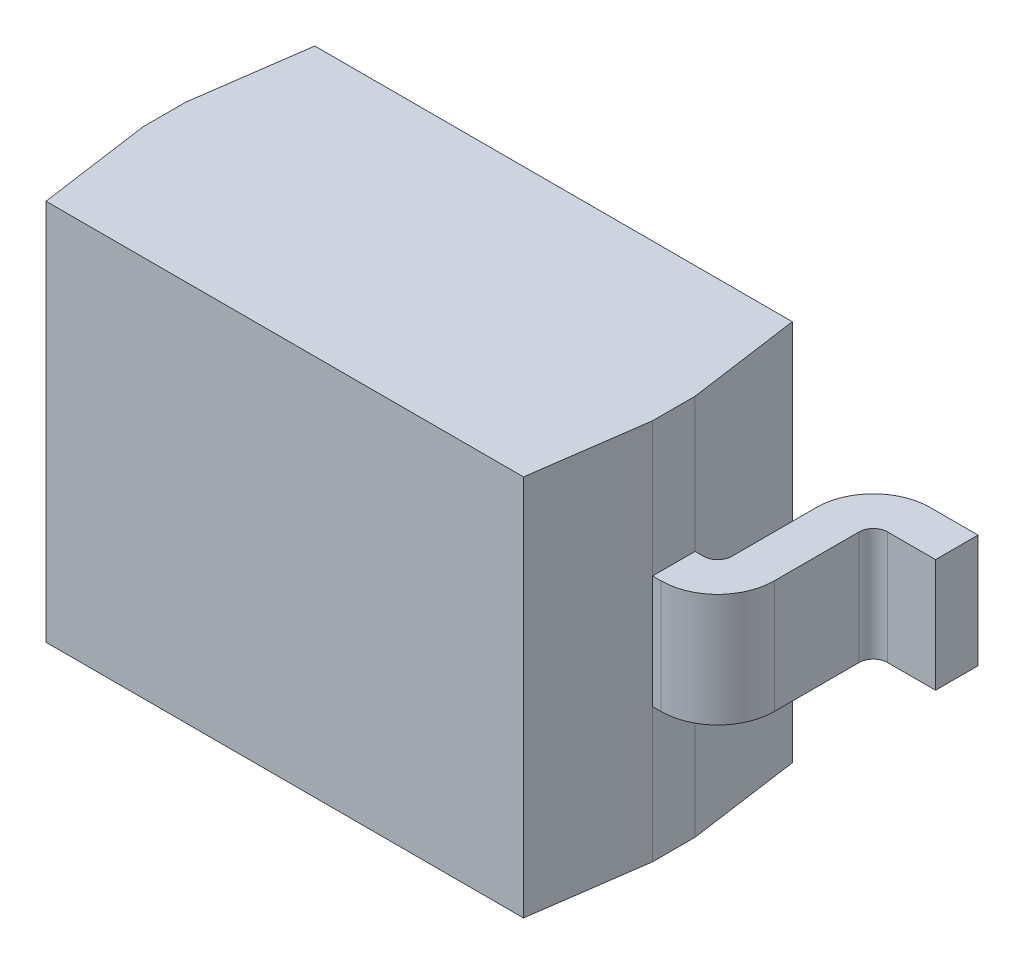
ISO-10303-21;
HEADER;
FILE_DESCRIPTION(('STEP AP214'),'2;1');
FILE_NAME('part.step','',(''),(''),'','','');
FILE_SCHEMA(('AUTOMOTIVE_DESIGN { 1 0 10303 214 1 1 1 1 }'));
ENDSEC;
DATA;
#1=APPLICATION_CONTEXT('core data for automotive mechanical design processes');
#2=APPLICATION_PROTOCOL_DEFINITION('international standard','automotive_design',2000,#1);
#3=PRODUCT_CONTEXT('',#1,'mechanical');
#4=PRODUCT('Part','Part','',(#3));
#5=PRODUCT_RELATED_PRODUCT_CATEGORY('part','',(#4));
#6=PRODUCT_DEFINITION_FORMATION('','',#4);
#7=PRODUCT_DEFINITION_CONTEXT('part definition',#1,'design');
#8=PRODUCT_DEFINITION('design','',#6,#7);
#9=PRODUCT_DEFINITION_SHAPE('','',#8);
#10=(LENGTH_UNIT() NAMED_UNIT(*) SI_UNIT(.MILLI.,.METRE.));
#11=(NAMED_UNIT(*) PLANE_ANGLE_UNIT() SI_UNIT($,.RADIAN.));
#12=(NAMED_UNIT(*) SI_UNIT($,.STERADIAN.) SOLID_ANGLE_UNIT());
#13=UNCERTAINTY_MEASURE_WITH_UNIT(LENGTH_MEASURE(1.E-05),#10,'distance_accuracy_value','');
#14=(GEOMETRIC_REPRESENTATION_CONTEXT(3) GLOBAL_UNCERTAINTY_ASSIGNED_CONTEXT((#13)) GLOBAL_UNIT_ASSIGNED_CONTEXT((#10,
#11,#12)) REPRESENTATION_CONTEXT('',''));
#15=CARTESIAN_POINT('',(0.,0.,0.));
#16=DIRECTION('',(0.,0.,1.));
#17=DIRECTION('',(1.,0.,0.));
#18=AXIS2_PLACEMENT_3D('',#15,#16,#17);
#19=CARTESIAN_POINT('',(0.93,0.2,0.5));
#20=DIRECTION('',(0.,-1.,0.));
#21=DIRECTION('',(0.,0.,-1.));
#22=AXIS2_PLACEMENT_3D('',#19,#20,#21);
#23=CYLINDRICAL_SURFACE('',#22,0.2);
#24=CARTESIAN_POINT('',(0.93,-0.2,0.5));
#25=DIRECTION('',(0.,-1.,0.));
#26=DIRECTION('',(0.,0.,-1.));
#27=AXIS2_PLACEMENT_3D('',#24,#25,#26);
#28=CIRCLE('',#27,0.2);
#29=CARTESIAN_POINT('',(0.93,-0.2,0.7));
#30=VERTEX_POINT('',#29);
#31=CARTESIAN_POINT('',(1.13,-0.2,0.5));
#32=VERTEX_POINT('',#31);
#33=EDGE_CURVE('E20',#30,#32,#28,.F.);
#34=ORIENTED_EDGE('',*,*,#33,.T.);
#35=DIRECTION('',(0.,1.,0.));
#36=VECTOR('',#35,1.);
#37=CARTESIAN_POINT('',(1.13,0.2,0.5));
#38=LINE('',#37,#36);
#39=CARTESIAN_POINT('',(1.13,0.2,0.5));
#40=VERTEX_POINT('',#39);
#41=EDGE_CURVE('E230',#40,#32,#38,.F.);
#42=ORIENTED_EDGE('',*,*,#41,.F.);
#43=CARTESIAN_POINT('',(0.93,0.2,0.5));
#44=DIRECTION('',(0.,-1.,0.));
#45=DIRECTION('',(0.,0.,-1.));
#46=AXIS2_PLACEMENT_3D('',#43,#44,#45);
#47=CIRCLE('',#46,0.2);
#48=CARTESIAN_POINT('',(0.93,0.2,0.7));
#49=VERTEX_POINT('',#48);
#50=EDGE_CURVE('E452',#49,#40,#47,.F.);
#51=ORIENTED_EDGE('',*,*,#50,.F.);
#52=DIRECTION('',(0.,-1.,0.));
#53=VECTOR('',#52,1.);
#54=CARTESIAN_POINT('',(0.93,0.2,0.7));
#55=LINE('',#54,#53);
#56=EDGE_CURVE('E223',#30,#49,#55,.F.);
#57=ORIENTED_EDGE('',*,*,#56,.F.);
#58=EDGE_LOOP('',(#34,#42,#51,#57));
#59=FACE_BOUND('',#58,.T.);
#60=ADVANCED_FACE('F17',(#59),#23,.T.);
#61=CARTESIAN_POINT('',(1.13,0.2,0.2));
#62=DIRECTION('',(1.,0.,0.));
#63=DIRECTION('',(0.,0.,-1.));
#64=AXIS2_PLACEMENT_3D('',#61,#62,#63);
#65=PLANE('',#64);
#66=DIRECTION('',(0.,0.,1.));
#67=VECTOR('',#66,1.);
#68=CARTESIAN_POINT('',(1.13,-0.2,0.7));
#69=LINE('',#68,#67);
#70=CARTESIAN_POINT('',(1.13,-0.2,0.2));
#71=VERTEX_POINT('',#70);
#72=EDGE_CURVE('E234',#32,#71,#69,.F.);
#73=ORIENTED_EDGE('',*,*,#72,.T.);
#74=DIRECTION('',(0.,-1.,0.));
#75=VECTOR('',#74,1.);
#76=CARTESIAN_POINT('',(1.13,0.2,0.2));
#77=LINE('',#76,#75);
#78=CARTESIAN_POINT('',(1.13,0.2,0.2));
#79=VERTEX_POINT('',#78);
#80=EDGE_CURVE('E236',#71,#79,#77,.F.);
#81=ORIENTED_EDGE('',*,*,#80,.T.);
#82=DIRECTION('',(0.,0.,1.));
#83=VECTOR('',#82,1.);
#84=CARTESIAN_POINT('',(1.13,0.2,0.7));
#85=LINE('',#84,#83);
#86=EDGE_CURVE('E235',#40,#79,#85,.F.);
#87=ORIENTED_EDGE('',*,*,#86,.F.);
#88=ORIENTED_EDGE('',*,*,#41,.T.);
#89=EDGE_LOOP('',(#73,#81,#87,#88));
#90=FACE_BOUND('',#89,.T.);
#91=ADVANCED_FACE('F232',(#90),#65,.T.);
#92=CARTESIAN_POINT('',(1.18,0.2,0.2));
#93=DIRECTION('',(0.,-1.,0.));
#94=DIRECTION('',(0.,0.,-1.));
#95=AXIS2_PLACEMENT_3D('',#92,#93,#94);
#96=CYLINDRICAL_SURFACE('',#95,0.05);
#97=ORIENTED_EDGE('',*,*,#80,.F.);
#98=CARTESIAN_POINT('',(1.18,-0.2,0.2));
#99=DIRECTION('',(0.,-1.,0.));
#100=DIRECTION('',(0.,0.,-1.));
#101=AXIS2_PLACEMENT_3D('',#98,#99,#100);
#102=CIRCLE('',#101,0.05);
#103=CARTESIAN_POINT('',(1.18,-0.2,0.15));
#104=VERTEX_POINT('',#103);
#105=EDGE_CURVE('E245',#71,#104,#102,.T.);
#106=ORIENTED_EDGE('',*,*,#105,.T.);
#107=DIRECTION('',(0.,-1.,0.));
#108=VECTOR('',#107,1.);
#109=CARTESIAN_POINT('',(1.18,0.2,0.15));
#110=LINE('',#109,#108);
#111=CARTESIAN_POINT('',(1.18,0.2,0.15));
#112=VERTEX_POINT('',#111);
#113=EDGE_CURVE('E396',#112,#104,#110,.T.);
#114=ORIENTED_EDGE('',*,*,#113,.F.);
#115=CARTESIAN_POINT('',(1.18,0.2,0.2));
#116=DIRECTION('',(0.,-1.,0.));
#117=DIRECTION('',(0.,0.,-1.));
#118=AXIS2_PLACEMENT_3D('',#115,#116,#117);
#119=CIRCLE('',#118,0.05);
#120=EDGE_CURVE('E450',#79,#112,#119,.T.);
#121=ORIENTED_EDGE('',*,*,#120,.F.);
#122=EDGE_LOOP('',(#97,#106,#114,#121));
#123=FACE_BOUND('',#122,.T.);
#124=ADVANCED_FACE('F724',(#123),#96,.F.);
#125=CARTESIAN_POINT('',(1.35,0.2,0.15));
#126=DIRECTION('',(0.,0.,1.));
#127=DIRECTION('',(0.,-1.,0.));
#128=AXIS2_PLACEMENT_3D('',#125,#126,#127);
#129=PLANE('',#128);
#130=DIRECTION('',(1.,0.,0.));
#131=VECTOR('',#130,1.);
#132=CARTESIAN_POINT('',(0.9,-0.2,0.15));
#133=LINE('',#132,#131);
#134=CARTESIAN_POINT('',(1.35,-0.2,0.15));
#135=VERTEX_POINT('',#134);
#136=EDGE_CURVE('E414',#104,#135,#133,.T.);
#137=ORIENTED_EDGE('',*,*,#136,.T.);
#138=DIRECTION('',(0.,1.,0.));
#139=VECTOR('',#138,1.);
#140=CARTESIAN_POINT('',(1.35,0.2,0.15));
#141=LINE('',#140,#139);
#142=CARTESIAN_POINT('',(1.35,0.2,0.15));
#143=VERTEX_POINT('',#142);
#144=EDGE_CURVE('E386',#143,#135,#141,.F.);
#145=ORIENTED_EDGE('',*,*,#144,.F.);
#146=DIRECTION('',(1.,0.,0.));
#147=VECTOR('',#146,1.);
#148=CARTESIAN_POINT('',(0.9,0.2,0.15));
#149=LINE('',#148,#147);
#150=EDGE_CURVE('E392',#112,#143,#149,.T.);
#151=ORIENTED_EDGE('',*,*,#150,.F.);
#152=ORIENTED_EDGE('',*,*,#113,.T.);
#153=EDGE_LOOP('',(#137,#145,#151,#152));
#154=FACE_BOUND('',#153,.T.);
#155=ADVANCED_FACE('F720',(#154),#129,.T.);
#156=CARTESIAN_POINT('',(1.35,0.2,0.));
#157=DIRECTION('',(1.,0.,0.));
#158=DIRECTION('',(0.,0.,-1.));
#159=AXIS2_PLACEMENT_3D('',#156,#157,#158);
#160=PLANE('',#159);
#161=DIRECTION('',(0.,0.,1.));
#162=VECTOR('',#161,1.);
#163=CARTESIAN_POINT('',(1.35,-0.2,0.7));
#164=LINE('',#163,#162);
#165=CARTESIAN_POINT('',(1.35,-0.2,0.));
#166=VERTEX_POINT('',#165);
#167=EDGE_CURVE('E410',#135,#166,#164,.F.);
#168=ORIENTED_EDGE('',*,*,#167,.T.);
#169=DIRECTION('',(0.,1.,0.));
#170=VECTOR('',#169,1.);
#171=CARTESIAN_POINT('',(1.35,0.2,0.));
#172=LINE('',#171,#170);
#173=CARTESIAN_POINT('',(1.35,0.2,0.));
#174=VERTEX_POINT('',#173);
#175=EDGE_CURVE('E384',#174,#166,#172,.F.);
#176=ORIENTED_EDGE('',*,*,#175,.F.);
#177=DIRECTION('',(0.,0.,1.));
#178=VECTOR('',#177,1.);
#179=CARTESIAN_POINT('',(1.35,0.2,0.7));
#180=LINE('',#179,#178);
#181=EDGE_CURVE('E389',#143,#174,#180,.F.);
#182=ORIENTED_EDGE('',*,*,#181,.F.);
#183=ORIENTED_EDGE('',*,*,#144,.T.);
#184=EDGE_LOOP('',(#168,#176,#182,#183));
#185=FACE_BOUND('',#184,.T.);
#186=ADVANCED_FACE('F716',(#185),#160,.T.);
#187=CARTESIAN_POINT('',(1.18,0.2,0.));
#188=DIRECTION('',(0.,0.,-1.));
#189=DIRECTION('',(0.,1.,0.));
#190=AXIS2_PLACEMENT_3D('',#187,#188,#189);
#191=PLANE('',#190);
#192=DIRECTION('',(1.,0.,0.));
#193=VECTOR('',#192,1.);
#194=CARTESIAN_POINT('',(0.9,-0.2,0.));
#195=LINE('',#194,#193);
#196=CARTESIAN_POINT('',(1.18,-0.2,0.));
#197=VERTEX_POINT('',#196);
#198=EDGE_CURVE('E413',#166,#197,#195,.F.);
#199=ORIENTED_EDGE('',*,*,#198,.T.);
#200=DIRECTION('',(0.,-1.,0.));
#201=VECTOR('',#200,1.);
#202=CARTESIAN_POINT('',(1.18,0.2,0.));
#203=LINE('',#202,#201);
#204=CARTESIAN_POINT('',(1.18,0.2,0.));
#205=VERTEX_POINT('',#204);
#206=EDGE_CURVE('E382',#205,#197,#203,.T.);
#207=ORIENTED_EDGE('',*,*,#206,.F.);
#208=DIRECTION('',(1.,0.,0.));
#209=VECTOR('',#208,1.);
#210=CARTESIAN_POINT('',(0.9,0.2,0.));
#211=LINE('',#210,#209);
#212=EDGE_CURVE('E391',#174,#205,#211,.F.);
#213=ORIENTED_EDGE('',*,*,#212,.F.);
#214=ORIENTED_EDGE('',*,*,#175,.T.);
#215=EDGE_LOOP('',(#199,#207,#213,#214));
#216=FACE_BOUND('',#215,.T.);
#217=ADVANCED_FACE('F712',(#216),#191,.T.);
#218=CARTESIAN_POINT('',(1.18,0.2,0.2));
#219=DIRECTION('',(0.,-1.,0.));
#220=DIRECTION('',(0.,0.,-1.));
#221=AXIS2_PLACEMENT_3D('',#218,#219,#220);
#222=CYLINDRICAL_SURFACE('',#221,0.2);
#223=CARTESIAN_POINT('',(1.18,-0.2,0.2));
#224=DIRECTION('',(0.,-1.,0.));
#225=DIRECTION('',(0.,0.,-1.));
#226=AXIS2_PLACEMENT_3D('',#223,#224,#225);
#227=CIRCLE('',#226,0.2);
#228=CARTESIAN_POINT('',(0.98,-0.2,0.2));
#229=VERTEX_POINT('',#228);
#230=EDGE_CURVE('E459',#197,#229,#227,.F.);
#231=ORIENTED_EDGE('',*,*,#230,.T.);
#232=DIRECTION('',(0.,1.,0.));
#233=VECTOR('',#232,1.);
#234=CARTESIAN_POINT('',(0.98,0.2,0.2));
#235=LINE('',#234,#233);
#236=CARTESIAN_POINT('',(0.98,0.2,0.2));
#237=VERTEX_POINT('',#236);
#238=EDGE_CURVE('E380',#237,#229,#235,.F.);
#239=ORIENTED_EDGE('',*,*,#238,.F.);
#240=CARTESIAN_POINT('',(1.18,0.2,0.2));
#241=DIRECTION('',(0.,-1.,0.));
#242=DIRECTION('',(0.,0.,-1.));
#243=AXIS2_PLACEMENT_3D('',#240,#241,#242);
#244=CIRCLE('',#243,0.2);
#245=EDGE_CURVE('E448',#205,#237,#244,.F.);
#246=ORIENTED_EDGE('',*,*,#245,.F.);
#247=ORIENTED_EDGE('',*,*,#206,.T.);
#248=EDGE_LOOP('',(#231,#239,#246,#247));
#249=FACE_BOUND('',#248,.T.);
#250=ADVANCED_FACE('F708',(#249),#222,.T.);
#251=CARTESIAN_POINT('',(0.98,0.2,0.5));
#252=DIRECTION('',(-1.,0.,0.));
#253=DIRECTION('',(0.,0.,1.));
#254=AXIS2_PLACEMENT_3D('',#251,#252,#253);
#255=PLANE('',#254);
#256=DIRECTION('',(0.,0.,1.));
#257=VECTOR('',#256,1.);
#258=CARTESIAN_POINT('',(0.98,-0.2,0.7));
#259=LINE('',#258,#257);
#260=CARTESIAN_POINT('',(0.98,-0.2,0.5));
#261=VERTEX_POINT('',#260);
#262=EDGE_CURVE('E458',#229,#261,#259,.T.);
#263=ORIENTED_EDGE('',*,*,#262,.T.);
#264=DIRECTION('',(0.,-1.,0.));
#265=VECTOR('',#264,1.);
#266=CARTESIAN_POINT('',(0.98,0.2,0.5));
#267=LINE('',#266,#265);
#268=CARTESIAN_POINT('',(0.98,0.2,0.5));
#269=VERTEX_POINT('',#268);
#270=EDGE_CURVE('E248',#261,#269,#267,.F.);
#271=ORIENTED_EDGE('',*,*,#270,.T.);
#272=DIRECTION('',(0.,0.,1.));
#273=VECTOR('',#272,1.);
#274=CARTESIAN_POINT('',(0.98,0.2,0.7));
#275=LINE('',#274,#273);
#276=EDGE_CURVE('E447',#237,#269,#275,.T.);
#277=ORIENTED_EDGE('',*,*,#276,.F.);
#278=ORIENTED_EDGE('',*,*,#238,.T.);
#279=EDGE_LOOP('',(#263,#271,#277,#278));
#280=FACE_BOUND('',#279,.T.);
#281=ADVANCED_FACE('F705',(#280),#255,.T.);
#282=CARTESIAN_POINT('',(0.93,0.2,0.7));
#283=DIRECTION('',(0.,0.,1.));
#284=DIRECTION('',(0.,-1.,0.));
#285=AXIS2_PLACEMENT_3D('',#282,#283,#284);
#286=PLANE('',#285);
#287=DIRECTION('',(1.,0.,0.));
#288=VECTOR('',#287,1.);
#289=CARTESIAN_POINT('',(0.9,-0.2,0.7));
#290=LINE('',#289,#288);
#291=CARTESIAN_POINT('',(0.9,-0.2,0.7));
#292=VERTEX_POINT('',#291);
#293=EDGE_CURVE('E247',#292,#30,#290,.T.);
#294=ORIENTED_EDGE('',*,*,#293,.T.);
#295=ORIENTED_EDGE('',*,*,#56,.T.);
#296=DIRECTION('',(1.,0.,0.));
#297=VECTOR('',#296,1.);
#298=CARTESIAN_POINT('',(0.9,0.2,0.7));
#299=LINE('',#298,#297);
#300=CARTESIAN_POINT('',(0.9,0.2,0.7));
#301=VERTEX_POINT('',#300);
#302=EDGE_CURVE('E454',#301,#49,#299,.T.);
#303=ORIENTED_EDGE('',*,*,#302,.F.);
#304=DIRECTION('',(0.,1.,0.));
#305=VECTOR('',#304,1.);
#306=CARTESIAN_POINT('',(0.9,0.,0.7));
#307=LINE('',#306,#305);
#308=EDGE_CURVE('E366',#292,#301,#307,.T.);
#309=ORIENTED_EDGE('',*,*,#308,.F.);
#310=EDGE_LOOP('',(#294,#295,#303,#309));
#311=FACE_BOUND('',#310,.T.);
#312=ADVANCED_FACE('F701',(#311),#286,.T.);
#313=CARTESIAN_POINT('',(-0.93,-0.2,0.7));
#314=DIRECTION('',(0.,0.,1.));
#315=DIRECTION('',(0.,-1.,0.));
#316=AXIS2_PLACEMENT_3D('',#313,#314,#315);
#317=PLANE('',#316);
#318=DIRECTION('',(1.,0.,0.));
#319=VECTOR('',#318,1.);
#320=CARTESIAN_POINT('',(-0.9,0.2,0.7));
#321=LINE('',#320,#319);
#322=CARTESIAN_POINT('',(-0.9,0.2,0.7));
#323=VERTEX_POINT('',#322);
#324=CARTESIAN_POINT('',(-0.93,0.2,0.7));
#325=VERTEX_POINT('',#324);
#326=EDGE_CURVE('E434',#323,#325,#321,.F.);
#327=ORIENTED_EDGE('',*,*,#326,.T.);
#328=DIRECTION('',(0.,1.,0.));
#329=VECTOR('',#328,1.);
#330=CARTESIAN_POINT('',(-0.93,-0.2,0.7));
#331=LINE('',#330,#329);
#332=CARTESIAN_POINT('',(-0.93,-0.2,0.7));
#333=VERTEX_POINT('',#332);
#334=EDGE_CURVE('E330',#333,#325,#331,.T.);
#335=ORIENTED_EDGE('',*,*,#334,.F.);
#336=DIRECTION('',(1.,0.,0.));
#337=VECTOR('',#336,1.);
#338=CARTESIAN_POINT('',(-0.9,-0.2,0.7));
#339=LINE('',#338,#337);
#340=CARTESIAN_POINT('',(-0.9,-0.2,0.7));
#341=VERTEX_POINT('',#340);
#342=EDGE_CURVE('E353',#341,#333,#339,.F.);
#343=ORIENTED_EDGE('',*,*,#342,.F.);
#344=DIRECTION('',(0.,1.,0.));
#345=VECTOR('',#344,1.);
#346=CARTESIAN_POINT('',(-0.9,0.,0.7));
#347=LINE('',#346,#345);
#348=EDGE_CURVE('E338',#323,#341,#347,.F.);
#349=ORIENTED_EDGE('',*,*,#348,.F.);
#350=EDGE_LOOP('',(#327,#335,#343,#349));
#351=FACE_BOUND('',#350,.T.);
#352=ADVANCED_FACE('F697',(#351),#317,.T.);
#353=CARTESIAN_POINT('',(-0.93,-0.2,0.5));
#354=DIRECTION('',(0.,1.,0.));
#355=DIRECTION('',(-1.,0.,0.));
#356=AXIS2_PLACEMENT_3D('',#353,#354,#355);
#357=CYLINDRICAL_SURFACE('',#356,0.2);
#358=CARTESIAN_POINT('',(-0.93,0.2,0.5));
#359=DIRECTION('',(0.,1.,0.));
#360=DIRECTION('',(-1.,0.,0.));
#361=AXIS2_PLACEMENT_3D('',#358,#359,#360);
#362=CIRCLE('',#361,0.2);
#363=CARTESIAN_POINT('',(-1.13,0.2,0.5));
#364=VERTEX_POINT('',#363);
#365=EDGE_CURVE('E431',#325,#364,#362,.F.);
#366=ORIENTED_EDGE('',*,*,#365,.T.);
#367=DIRECTION('',(0.,-1.,0.));
#368=VECTOR('',#367,1.);
#369=CARTESIAN_POINT('',(-1.13,-0.2,0.5));
#370=LINE('',#369,#368);
#371=CARTESIAN_POINT('',(-1.13,-0.2,0.5));
#372=VERTEX_POINT('',#371);
#373=EDGE_CURVE('E328',#372,#364,#370,.F.);
#374=ORIENTED_EDGE('',*,*,#373,.F.);
#375=CARTESIAN_POINT('',(-0.93,-0.2,0.5));
#376=DIRECTION('',(0.,1.,0.));
#377=DIRECTION('',(-1.,0.,0.));
#378=AXIS2_PLACEMENT_3D('',#375,#376,#377);
#379=CIRCLE('',#378,0.2);
#380=EDGE_CURVE('E442',#333,#372,#379,.F.);
#381=ORIENTED_EDGE('',*,*,#380,.F.);
#382=ORIENTED_EDGE('',*,*,#334,.T.);
#383=EDGE_LOOP('',(#366,#374,#381,#382));
#384=FACE_BOUND('',#383,.T.);
#385=ADVANCED_FACE('F693',(#384),#357,.T.);
#386=CARTESIAN_POINT('',(-1.13,-0.2,0.2));
#387=DIRECTION('',(-1.,0.,0.));
#388=DIRECTION('',(0.,-1.,0.));
#389=AXIS2_PLACEMENT_3D('',#386,#387,#388);
#390=PLANE('',#389);
#391=DIRECTION('',(0.,0.,1.));
#392=VECTOR('',#391,1.);
#393=CARTESIAN_POINT('',(-1.13,0.2,0.7));
#394=LINE('',#393,#392);
#395=CARTESIAN_POINT('',(-1.13,0.2,0.2));
#396=VERTEX_POINT('',#395);
#397=EDGE_CURVE('E430',#364,#396,#394,.F.);
#398=ORIENTED_EDGE('',*,*,#397,.T.);
#399=DIRECTION('',(0.,1.,0.));
#400=VECTOR('',#399,1.);
#401=CARTESIAN_POINT('',(-1.13,-0.2,0.2));
#402=LINE('',#401,#400);
#403=CARTESIAN_POINT('',(-1.13,-0.2,0.2));
#404=VERTEX_POINT('',#403);
#405=EDGE_CURVE('E325',#396,#404,#402,.F.);
#406=ORIENTED_EDGE('',*,*,#405,.T.);
#407=DIRECTION('',(0.,0.,1.));
#408=VECTOR('',#407,1.);
#409=CARTESIAN_POINT('',(-1.13,-0.2,0.7));
#410=LINE('',#409,#408);
#411=EDGE_CURVE('E441',#372,#404,#410,.F.);
#412=ORIENTED_EDGE('',*,*,#411,.F.);
#413=ORIENTED_EDGE('',*,*,#373,.T.);
#414=EDGE_LOOP('',(#398,#406,#412,#413));
#415=FACE_BOUND('',#414,.T.);
#416=ADVANCED_FACE('F689',(#415),#390,.T.);
#417=CARTESIAN_POINT('',(-1.18,-0.2,0.2));
#418=DIRECTION('',(0.,1.,0.));
#419=DIRECTION('',(-1.,0.,0.));
#420=AXIS2_PLACEMENT_3D('',#417,#418,#419);
#421=CYLINDRICAL_SURFACE('',#420,0.05);
#422=ORIENTED_EDGE('',*,*,#405,.F.);
#423=CARTESIAN_POINT('',(-1.18,0.2,0.2));
#424=DIRECTION('',(0.,1.,0.));
#425=DIRECTION('',(-1.,0.,0.));
#426=AXIS2_PLACEMENT_3D('',#423,#424,#425);
#427=CIRCLE('',#426,0.05);
#428=CARTESIAN_POINT('',(-1.18,0.2,0.15));
#429=VERTEX_POINT('',#428);
#430=EDGE_CURVE('E427',#396,#429,#427,.T.);
#431=ORIENTED_EDGE('',*,*,#430,.T.);
#432=DIRECTION('',(0.,-1.,0.));
#433=VECTOR('',#432,1.);
#434=CARTESIAN_POINT('',(-1.18,-0.2,0.15));
#435=LINE('',#434,#433);
#436=CARTESIAN_POINT('',(-1.18,-0.2,0.15));
#437=VERTEX_POINT('',#436);
#438=EDGE_CURVE('E321',#437,#429,#435,.F.);
#439=ORIENTED_EDGE('',*,*,#438,.F.);
#440=CARTESIAN_POINT('',(-1.18,-0.2,0.2));
#441=DIRECTION('',(0.,1.,0.));
#442=DIRECTION('',(-1.,0.,0.));
#443=AXIS2_PLACEMENT_3D('',#440,#441,#442);
#444=CIRCLE('',#443,0.05);
#445=EDGE_CURVE('E439',#404,#437,#444,.T.);
#446=ORIENTED_EDGE('',*,*,#445,.F.);
#447=EDGE_LOOP('',(#422,#431,#439,#446));
#448=FACE_BOUND('',#447,.T.);
#449=ADVANCED_FACE('F685',(#448),#421,.F.);
#450=CARTESIAN_POINT('',(-1.35,-0.2,0.15));
#451=DIRECTION('',(0.,0.,1.));
#452=DIRECTION('',(0.,-1.,0.));
#453=AXIS2_PLACEMENT_3D('',#450,#451,#452);
#454=PLANE('',#453);
#455=DIRECTION('',(1.,0.,0.));
#456=VECTOR('',#455,1.);
#457=CARTESIAN_POINT('',(-0.9,0.2,0.15));
#458=LINE('',#457,#456);
#459=CARTESIAN_POINT('',(-1.35,0.2,0.15));
#460=VERTEX_POINT('',#459);
#461=EDGE_CURVE('E317',#429,#460,#458,.F.);
#462=ORIENTED_EDGE('',*,*,#461,.T.);
#463=DIRECTION('',(0.,-1.,0.));
#464=VECTOR('',#463,1.);
#465=CARTESIAN_POINT('',(-1.35,-0.2,0.15));
#466=LINE('',#465,#464);
#467=CARTESIAN_POINT('',(-1.35,-0.2,0.15));
#468=VERTEX_POINT('',#467);
#469=EDGE_CURVE('E310',#468,#460,#466,.F.);
#470=ORIENTED_EDGE('',*,*,#469,.F.);
#471=DIRECTION('',(1.,0.,0.));
#472=VECTOR('',#471,1.);
#473=CARTESIAN_POINT('',(-0.9,-0.2,0.15));
#474=LINE('',#473,#472);
#475=EDGE_CURVE('E335',#437,#468,#474,.F.);
#476=ORIENTED_EDGE('',*,*,#475,.F.);
#477=ORIENTED_EDGE('',*,*,#438,.T.);
#478=EDGE_LOOP('',(#462,#470,#476,#477));
#479=FACE_BOUND('',#478,.T.);
#480=ADVANCED_FACE('F681',(#479),#454,.T.);
#481=CARTESIAN_POINT('',(-1.35,-0.2,0.));
#482=DIRECTION('',(-1.,0.,0.));
#483=DIRECTION('',(0.,-1.,0.));
#484=AXIS2_PLACEMENT_3D('',#481,#482,#483);
#485=PLANE('',#484);
#486=DIRECTION('',(0.,0.,1.));
#487=VECTOR('',#486,1.);
#488=CARTESIAN_POINT('',(-1.35,0.2,0.7));
#489=LINE('',#488,#487);
#490=CARTESIAN_POINT('',(-1.35,0.2,0.));
#491=VERTEX_POINT('',#490);
#492=EDGE_CURVE('E313',#460,#491,#489,.F.);
#493=ORIENTED_EDGE('',*,*,#492,.T.);
#494=DIRECTION('',(0.,1.,0.));
#495=VECTOR('',#494,1.);
#496=CARTESIAN_POINT('',(-1.35,-0.2,0.));
#497=LINE('',#496,#495);
#498=CARTESIAN_POINT('',(-1.35,-0.2,0.));
#499=VERTEX_POINT('',#498);
#500=EDGE_CURVE('E308',#499,#491,#497,.T.);
#501=ORIENTED_EDGE('',*,*,#500,.F.);
#502=DIRECTION('',(0.,0.,1.));
#503=VECTOR('',#502,1.);
#504=CARTESIAN_POINT('',(-1.35,-0.2,0.7));
#505=LINE('',#504,#503);
#506=EDGE_CURVE('E332',#468,#499,#505,.F.);
#507=ORIENTED_EDGE('',*,*,#506,.F.);
#508=ORIENTED_EDGE('',*,*,#469,.T.);
#509=EDGE_LOOP('',(#493,#501,#507,#508));
#510=FACE_BOUND('',#509,.T.);
#511=ADVANCED_FACE('F677',(#510),#485,.T.);
#512=CARTESIAN_POINT('',(-1.18,-0.2,0.));
#513=DIRECTION('',(0.,0.,-1.));
#514=DIRECTION('',(0.,1.,0.));
#515=AXIS2_PLACEMENT_3D('',#512,#513,#514);
#516=PLANE('',#515);
#517=DIRECTION('',(1.,0.,0.));
#518=VECTOR('',#517,1.);
#519=CARTESIAN_POINT('',(-0.9,0.2,0.));
#520=LINE('',#519,#518);
#521=CARTESIAN_POINT('',(-1.18,0.2,0.));
#522=VERTEX_POINT('',#521);
#523=EDGE_CURVE('E316',#491,#522,#520,.T.);
#524=ORIENTED_EDGE('',*,*,#523,.T.);
#525=DIRECTION('',(0.,1.,0.));
#526=VECTOR('',#525,1.);
#527=CARTESIAN_POINT('',(-1.18,-0.2,0.));
#528=LINE('',#527,#526);
#529=CARTESIAN_POINT('',(-1.18,-0.2,0.));
#530=VERTEX_POINT('',#529);
#531=EDGE_CURVE('E306',#530,#522,#528,.T.);
#532=ORIENTED_EDGE('',*,*,#531,.F.);
#533=DIRECTION('',(1.,0.,0.));
#534=VECTOR('',#533,1.);
#535=CARTESIAN_POINT('',(-0.9,-0.2,0.));
#536=LINE('',#535,#534);
#537=EDGE_CURVE('E334',#499,#530,#536,.T.);
#538=ORIENTED_EDGE('',*,*,#537,.F.);
#539=ORIENTED_EDGE('',*,*,#500,.T.);
#540=EDGE_LOOP('',(#524,#532,#538,#539));
#541=FACE_BOUND('',#540,.T.);
#542=ADVANCED_FACE('F673',(#541),#516,.T.);
#543=CARTESIAN_POINT('',(-1.18,-0.2,0.2));
#544=DIRECTION('',(0.,1.,0.));
#545=DIRECTION('',(-1.,0.,0.));
#546=AXIS2_PLACEMENT_3D('',#543,#544,#545);
#547=CYLINDRICAL_SURFACE('',#546,0.2);
#548=CARTESIAN_POINT('',(-1.18,0.2,0.2));
#549=DIRECTION('',(0.,1.,0.));
#550=DIRECTION('',(-1.,0.,0.));
#551=AXIS2_PLACEMENT_3D('',#548,#549,#550);
#552=CIRCLE('',#551,0.2);
#553=CARTESIAN_POINT('',(-0.98,0.2,0.2));
#554=VERTEX_POINT('',#553);
#555=EDGE_CURVE('E424',#522,#554,#552,.F.);
#556=ORIENTED_EDGE('',*,*,#555,.T.);
#557=DIRECTION('',(0.,1.,0.));
#558=VECTOR('',#557,1.);
#559=CARTESIAN_POINT('',(-0.98,-0.2,0.2));
#560=LINE('',#559,#558);
#561=CARTESIAN_POINT('',(-0.98,-0.2,0.2));
#562=VERTEX_POINT('',#561);
#563=EDGE_CURVE('E253',#562,#554,#560,.T.);
#564=ORIENTED_EDGE('',*,*,#563,.F.);
#565=CARTESIAN_POINT('',(-1.18,-0.2,0.2));
#566=DIRECTION('',(0.,1.,0.));
#567=DIRECTION('',(-1.,0.,0.));
#568=AXIS2_PLACEMENT_3D('',#565,#566,#567);
#569=CIRCLE('',#568,0.2);
#570=EDGE_CURVE('E437',#530,#562,#569,.F.);
#571=ORIENTED_EDGE('',*,*,#570,.F.);
#572=ORIENTED_EDGE('',*,*,#531,.T.);
#573=EDGE_LOOP('',(#556,#564,#571,#572));
#574=FACE_BOUND('',#573,.T.);
#575=ADVANCED_FACE('F669',(#574),#547,.T.);
#576=CARTESIAN_POINT('',(-0.98,-0.2,0.5));
#577=DIRECTION('',(1.,0.,0.));
#578=DIRECTION('',(0.,1.,0.));
#579=AXIS2_PLACEMENT_3D('',#576,#577,#578);
#580=PLANE('',#579);
#581=DIRECTION('',(0.,0.,1.));
#582=VECTOR('',#581,1.);
#583=CARTESIAN_POINT('',(-0.98,0.2,0.7));
#584=LINE('',#583,#582);
#585=CARTESIAN_POINT('',(-0.98,0.2,0.5));
#586=VERTEX_POINT('',#585);
#587=EDGE_CURVE('E423',#554,#586,#584,.T.);
#588=ORIENTED_EDGE('',*,*,#587,.T.);
#589=DIRECTION('',(0.,1.,0.));
#590=VECTOR('',#589,1.);
#591=CARTESIAN_POINT('',(-0.98,-0.2,0.5));
#592=LINE('',#591,#590);
#593=CARTESIAN_POINT('',(-0.98,-0.2,0.5));
#594=VERTEX_POINT('',#593);
#595=EDGE_CURVE('E300',#586,#594,#592,.F.);
#596=ORIENTED_EDGE('',*,*,#595,.T.);
#597=DIRECTION('',(0.,0.,1.));
#598=VECTOR('',#597,1.);
#599=CARTESIAN_POINT('',(-0.98,-0.2,0.7));
#600=LINE('',#599,#598);
#601=EDGE_CURVE('E304',#562,#594,#600,.T.);
#602=ORIENTED_EDGE('',*,*,#601,.F.);
#603=ORIENTED_EDGE('',*,*,#563,.T.);
#604=EDGE_LOOP('',(#588,#596,#602,#603));
#605=FACE_BOUND('',#604,.T.);
#606=ADVANCED_FACE('F665',(#605),#580,.T.);
#607=CARTESIAN_POINT('',(0.93,0.2,0.5));
#608=DIRECTION('',(0.,-1.,0.));
#609=DIRECTION('',(0.,0.,-1.));
#610=AXIS2_PLACEMENT_3D('',#607,#608,#609);
#611=CYLINDRICAL_SURFACE('',#610,0.05);
#612=ORIENTED_EDGE('',*,*,#270,.F.);
#613=CARTESIAN_POINT('',(0.93,-0.2,0.5));
#614=DIRECTION('',(0.,-1.,0.));
#615=DIRECTION('',(0.,0.,-1.));
#616=AXIS2_PLACEMENT_3D('',#613,#614,#615);
#617=CIRCLE('',#616,0.05);
#618=CARTESIAN_POINT('',(0.93,-0.2,0.55));
#619=VERTEX_POINT('',#618);
#620=EDGE_CURVE('E455',#261,#619,#617,.T.);
#621=ORIENTED_EDGE('',*,*,#620,.T.);
#622=DIRECTION('',(0.,1.,0.));
#623=VECTOR('',#622,1.);
#624=CARTESIAN_POINT('',(0.93,0.2,0.55));
#625=LINE('',#624,#623);
#626=CARTESIAN_POINT('',(0.93,0.2,0.55));
#627=VERTEX_POINT('',#626);
#628=EDGE_CURVE('E259',#627,#619,#625,.F.);
#629=ORIENTED_EDGE('',*,*,#628,.F.);
#630=CARTESIAN_POINT('',(0.93,0.2,0.5));
#631=DIRECTION('',(0.,-1.,0.));
#632=DIRECTION('',(0.,0.,-1.));
#633=AXIS2_PLACEMENT_3D('',#630,#631,#632);
#634=CIRCLE('',#633,0.05);
#635=EDGE_CURVE('E444',#269,#627,#634,.T.);
#636=ORIENTED_EDGE('',*,*,#635,.F.);
#637=EDGE_LOOP('',(#612,#621,#629,#636));
#638=FACE_BOUND('',#637,.T.);
#639=ADVANCED_FACE('F662',(#638),#611,.F.);
#640=CARTESIAN_POINT('',(0.9,-0.2,0.7));
#641=DIRECTION('',(0.,1.,0.));
#642=DIRECTION('',(0.,0.,1.));
#643=AXIS2_PLACEMENT_3D('',#640,#641,#642);
#644=PLANE('',#643);
#645=DIRECTION('',(1.,0.,0.));
#646=VECTOR('',#645,1.);
#647=CARTESIAN_POINT('',(0.9,-0.2,0.55));
#648=LINE('',#647,#646);
#649=CARTESIAN_POINT('',(0.9,-0.2,0.55));
#650=VERTEX_POINT('',#649);
#651=EDGE_CURVE('E261',#619,#650,#648,.F.);
#652=ORIENTED_EDGE('',*,*,#651,.F.);
#653=ORIENTED_EDGE('',*,*,#620,.F.);
#654=ORIENTED_EDGE('',*,*,#262,.F.);
#655=ORIENTED_EDGE('',*,*,#230,.F.);
#656=ORIENTED_EDGE('',*,*,#198,.F.);
#657=ORIENTED_EDGE('',*,*,#167,.F.);
#658=ORIENTED_EDGE('',*,*,#136,.F.);
#659=ORIENTED_EDGE('',*,*,#105,.F.);
#660=ORIENTED_EDGE('',*,*,#72,.F.);
#661=ORIENTED_EDGE('',*,*,#33,.F.);
#662=ORIENTED_EDGE('',*,*,#293,.F.);
#663=DIRECTION('',(0.,0.,1.));
#664=VECTOR('',#663,1.);
#665=CARTESIAN_POINT('',(0.9,-0.2,0.625));
#666=LINE('',#665,#664);
#667=EDGE_CURVE('E274',#292,#650,#666,.F.);
#668=ORIENTED_EDGE('',*,*,#667,.T.);
#669=EDGE_LOOP('',(#652,#653,#654,#655,#656,#657,#658,#659,#660,#661,#662,#668));
#670=FACE_BOUND('',#669,.T.);
#671=ADVANCED_FACE('F241',(#670),#644,.F.);
#672=CARTESIAN_POINT('',(0.9,0.2,0.7));
#673=DIRECTION('',(0.,1.,0.));
#674=DIRECTION('',(0.,0.,1.));
#675=AXIS2_PLACEMENT_3D('',#672,#673,#674);
#676=PLANE('',#675);
#677=ORIENTED_EDGE('',*,*,#635,.T.);
#678=DIRECTION('',(1.,0.,0.));
#679=VECTOR('',#678,1.);
#680=CARTESIAN_POINT('',(0.9,0.2,0.55));
#681=LINE('',#680,#679);
#682=CARTESIAN_POINT('',(0.9,0.2,0.55));
#683=VERTEX_POINT('',#682);
#684=EDGE_CURVE('E262',#683,#627,#681,.T.);
#685=ORIENTED_EDGE('',*,*,#684,.F.);
#686=DIRECTION('',(0.,0.,1.));
#687=VECTOR('',#686,1.);
#688=CARTESIAN_POINT('',(0.9,0.2,0.625));
#689=LINE('',#688,#687);
#690=EDGE_CURVE('E289',#683,#301,#689,.T.);
#691=ORIENTED_EDGE('',*,*,#690,.T.);
#692=ORIENTED_EDGE('',*,*,#302,.T.);
#693=ORIENTED_EDGE('',*,*,#50,.T.);
#694=ORIENTED_EDGE('',*,*,#86,.T.);
#695=ORIENTED_EDGE('',*,*,#120,.T.);
#696=ORIENTED_EDGE('',*,*,#150,.T.);
#697=ORIENTED_EDGE('',*,*,#181,.T.);
#698=ORIENTED_EDGE('',*,*,#212,.T.);
#699=ORIENTED_EDGE('',*,*,#245,.T.);
#700=ORIENTED_EDGE('',*,*,#276,.T.);
#701=EDGE_LOOP('',(#677,#685,#691,#692,#693,#694,#695,#696,#697,#698,#699,#700));
#702=FACE_BOUND('',#701,.T.);
#703=ADVANCED_FACE('F655',(#702),#676,.T.);
#704=CARTESIAN_POINT('',(0.871891833059522,0.,0.9));
#705=DIRECTION('',(0.99026806874157,0.,0.139173100960065));
#706=DIRECTION('',(0.139173100960065,0.,-0.99026806874157));
#707=AXIS2_PLACEMENT_3D('',#704,#705,#706);
#708=PLANE('',#707);
#709=ORIENTED_EDGE('',*,*,#308,.T.);
#710=DIRECTION('',(0.,1.,0.));
#711=VECTOR('',#710,1.);
#712=CARTESIAN_POINT('',(0.9,0.,0.7));
#713=LINE('',#712,#711);
#714=CARTESIAN_POINT('',(0.9,0.675,0.7));
#715=VERTEX_POINT('',#714);
#716=EDGE_CURVE('E277',#301,#715,#713,.T.);
#717=ORIENTED_EDGE('',*,*,#716,.T.);
#718=DIRECTION('',(0.139173100960065,0.,-0.99026806874157));
#719=VECTOR('',#718,1.);
#720=CARTESIAN_POINT('',(0.871891833059522,0.675,0.9));
#721=LINE('',#720,#719);
#722=CARTESIAN_POINT('',(0.843783666119044,0.675,1.1));
#723=VERTEX_POINT('',#722);
#724=EDGE_CURVE('E446',#715,#723,#721,.F.);
#725=ORIENTED_EDGE('',*,*,#724,.T.);
#726=DIRECTION('',(0.,1.,0.));
#727=VECTOR('',#726,1.);
#728=CARTESIAN_POINT('',(0.843783666119044,0.,1.1));
#729=LINE('',#728,#727);
#730=CARTESIAN_POINT('',(0.843783666119044,-0.675,1.1));
#731=VERTEX_POINT('',#730);
#732=EDGE_CURVE('E292',#723,#731,#729,.F.);
#733=ORIENTED_EDGE('',*,*,#732,.T.);
#734=DIRECTION('',(0.139173100960065,0.,-0.99026806874157));
#735=VECTOR('',#734,1.);
#736=CARTESIAN_POINT('',(0.871891833059522,-0.675,0.9));
#737=LINE('',#736,#735);
#738=CARTESIAN_POINT('',(0.9,-0.675,0.7));
#739=VERTEX_POINT('',#738);
#740=EDGE_CURVE('E403',#731,#739,#737,.T.);
#741=ORIENTED_EDGE('',*,*,#740,.T.);
#742=DIRECTION('',(0.,1.,0.));
#743=VECTOR('',#742,1.);
#744=CARTESIAN_POINT('',(0.9,0.,0.7));
#745=LINE('',#744,#743);
#746=EDGE_CURVE('E264',#739,#292,#745,.T.);
#747=ORIENTED_EDGE('',*,*,#746,.T.);
#748=EDGE_LOOP('',(#709,#717,#725,#733,#741,#747));
#749=FACE_BOUND('',#748,.T.);
#750=ADVANCED_FACE('F651',(#749),#708,.T.);
#751=CARTESIAN_POINT('',(-0.871891833059522,0.,0.9));
#752=DIRECTION('',(-0.99026806874157,0.,0.139173100960065));
#753=DIRECTION('',(0.139173100960065,0.,0.99026806874157));
#754=AXIS2_PLACEMENT_3D('',#751,#752,#753);
#755=PLANE('',#754);
#756=DIRECTION('',(0.139173100960065,0.,0.99026806874157));
#757=VECTOR('',#756,1.);
#758=CARTESIAN_POINT('',(-0.871891833059522,-0.675,0.9));
#759=LINE('',#758,#757);
#760=CARTESIAN_POINT('',(-0.9,-0.675,0.7));
#761=VERTEX_POINT('',#760);
#762=CARTESIAN_POINT('',(-0.843783666119043,-0.675,1.1));
#763=VERTEX_POINT('',#762);
#764=EDGE_CURVE('E345',#761,#763,#759,.T.);
#765=ORIENTED_EDGE('',*,*,#764,.T.);
#766=DIRECTION('',(0.,1.,0.));
#767=VECTOR('',#766,1.);
#768=CARTESIAN_POINT('',(-0.843783666119043,0.,1.1));
#769=LINE('',#768,#767);
#770=CARTESIAN_POINT('',(-0.843783666119044,0.675,1.1));
#771=VERTEX_POINT('',#770);
#772=EDGE_CURVE('E369',#763,#771,#769,.T.);
#773=ORIENTED_EDGE('',*,*,#772,.T.);
#774=DIRECTION('',(0.139173100960065,0.,0.99026806874157));
#775=VECTOR('',#774,1.);
#776=CARTESIAN_POINT('',(-0.871891833059522,0.675,0.9));
#777=LINE('',#776,#775);
#778=CARTESIAN_POINT('',(-0.9,0.675,0.7));
#779=VERTEX_POINT('',#778);
#780=EDGE_CURVE('E357',#771,#779,#777,.F.);
#781=ORIENTED_EDGE('',*,*,#780,.T.);
#782=DIRECTION('',(0.,1.,0.));
#783=VECTOR('',#782,1.);
#784=CARTESIAN_POINT('',(-0.9,0.,0.7));
#785=LINE('',#784,#783);
#786=EDGE_CURVE('E341',#779,#323,#785,.F.);
#787=ORIENTED_EDGE('',*,*,#786,.T.);
#788=ORIENTED_EDGE('',*,*,#348,.T.);
#789=DIRECTION('',(0.,1.,0.));
#790=VECTOR('',#789,1.);
#791=CARTESIAN_POINT('',(-0.9,0.,0.7));
#792=LINE('',#791,#790);
#793=EDGE_CURVE('E340',#341,#761,#792,.F.);
#794=ORIENTED_EDGE('',*,*,#793,.T.);
#795=EDGE_LOOP('',(#765,#773,#781,#787,#788,#794));
#796=FACE_BOUND('',#795,.T.);
#797=ADVANCED_FACE('F647',(#796),#755,.T.);
#798=CARTESIAN_POINT('',(-0.9,-0.2,0.7));
#799=DIRECTION('',(0.,-1.,0.));
#800=DIRECTION('',(1.,0.,0.));
#801=AXIS2_PLACEMENT_3D('',#798,#799,#800);
#802=PLANE('',#801);
#803=CARTESIAN_POINT('',(-0.93,-0.2,0.5));
#804=DIRECTION('',(0.,1.,0.));
#805=DIRECTION('',(-1.,0.,0.));
#806=AXIS2_PLACEMENT_3D('',#803,#804,#805);
#807=CIRCLE('',#806,0.05);
#808=CARTESIAN_POINT('',(-0.93,-0.2,0.55));
#809=VERTEX_POINT('',#808);
#810=EDGE_CURVE('E303',#594,#809,#807,.T.);
#811=ORIENTED_EDGE('',*,*,#810,.T.);
#812=DIRECTION('',(1.,0.,0.));
#813=VECTOR('',#812,1.);
#814=CARTESIAN_POINT('',(-0.9,-0.2,0.55));
#815=LINE('',#814,#813);
#816=CARTESIAN_POINT('',(-0.9,-0.2,0.55));
#817=VERTEX_POINT('',#816);
#818=EDGE_CURVE('E493',#817,#809,#815,.F.);
#819=ORIENTED_EDGE('',*,*,#818,.F.);
#820=DIRECTION('',(0.,0.,-1.));
#821=VECTOR('',#820,1.);
#822=CARTESIAN_POINT('',(-0.9,-0.2,0.625));
#823=LINE('',#822,#821);
#824=EDGE_CURVE('E372',#817,#341,#823,.F.);
#825=ORIENTED_EDGE('',*,*,#824,.T.);
#826=ORIENTED_EDGE('',*,*,#342,.T.);
#827=ORIENTED_EDGE('',*,*,#380,.T.);
#828=ORIENTED_EDGE('',*,*,#411,.T.);
#829=ORIENTED_EDGE('',*,*,#445,.T.);
#830=ORIENTED_EDGE('',*,*,#475,.T.);
#831=ORIENTED_EDGE('',*,*,#506,.T.);
#832=ORIENTED_EDGE('',*,*,#537,.T.);
#833=ORIENTED_EDGE('',*,*,#570,.T.);
#834=ORIENTED_EDGE('',*,*,#601,.T.);
#835=EDGE_LOOP('',(#811,#819,#825,#826,#827,#828,#829,#830,#831,#832,#833,#834));
#836=FACE_BOUND('',#835,.T.);
#837=ADVANCED_FACE('F643',(#836),#802,.T.);
#838=CARTESIAN_POINT('',(-0.93,-0.2,0.5));
#839=DIRECTION('',(0.,1.,0.));
#840=DIRECTION('',(-1.,0.,0.));
#841=AXIS2_PLACEMENT_3D('',#838,#839,#840);
#842=CYLINDRICAL_SURFACE('',#841,0.05);
#843=ORIENTED_EDGE('',*,*,#595,.F.);
#844=CARTESIAN_POINT('',(-0.93,0.2,0.5));
#845=DIRECTION('',(0.,1.,0.));
#846=DIRECTION('',(-1.,0.,0.));
#847=AXIS2_PLACEMENT_3D('',#844,#845,#846);
#848=CIRCLE('',#847,0.05);
#849=CARTESIAN_POINT('',(-0.93,0.2,0.55));
#850=VERTEX_POINT('',#849);
#851=EDGE_CURVE('E286',#586,#850,#848,.T.);
#852=ORIENTED_EDGE('',*,*,#851,.T.);
#853=DIRECTION('',(0.,1.,0.));
#854=VECTOR('',#853,1.);
#855=CARTESIAN_POINT('',(-0.93,-0.2,0.55));
#856=LINE('',#855,#854);
#857=EDGE_CURVE('E515',#809,#850,#856,.T.);
#858=ORIENTED_EDGE('',*,*,#857,.F.);
#859=ORIENTED_EDGE('',*,*,#810,.F.);
#860=EDGE_LOOP('',(#843,#852,#858,#859));
#861=FACE_BOUND('',#860,.T.);
#862=ADVANCED_FACE('F639',(#861),#842,.F.);
#863=CARTESIAN_POINT('',(-0.9,0.2,0.7));
#864=DIRECTION('',(0.,-1.,0.));
#865=DIRECTION('',(1.,0.,0.));
#866=AXIS2_PLACEMENT_3D('',#863,#864,#865);
#867=PLANE('',#866);
#868=DIRECTION('',(1.,0.,0.));
#869=VECTOR('',#868,1.);
#870=CARTESIAN_POINT('',(-0.9,0.2,0.55));
#871=LINE('',#870,#869);
#872=CARTESIAN_POINT('',(-0.9,0.2,0.55));
#873=VERTEX_POINT('',#872);
#874=EDGE_CURVE('E527',#850,#873,#871,.T.);
#875=ORIENTED_EDGE('',*,*,#874,.F.);
#876=ORIENTED_EDGE('',*,*,#851,.F.);
#877=ORIENTED_EDGE('',*,*,#587,.F.);
#878=ORIENTED_EDGE('',*,*,#555,.F.);
#879=ORIENTED_EDGE('',*,*,#523,.F.);
#880=ORIENTED_EDGE('',*,*,#492,.F.);
#881=ORIENTED_EDGE('',*,*,#461,.F.);
#882=ORIENTED_EDGE('',*,*,#430,.F.);
#883=ORIENTED_EDGE('',*,*,#397,.F.);
#884=ORIENTED_EDGE('',*,*,#365,.F.);
#885=ORIENTED_EDGE('',*,*,#326,.F.);
#886=DIRECTION('',(0.,0.,-1.));
#887=VECTOR('',#886,1.);
#888=CARTESIAN_POINT('',(-0.9,0.2,0.625));
#889=LINE('',#888,#887);
#890=EDGE_CURVE('E523',#323,#873,#889,.T.);
#891=ORIENTED_EDGE('',*,*,#890,.T.);
#892=EDGE_LOOP('',(#875,#876,#877,#878,#879,#880,#881,#882,#883,#884,#885,#891));
#893=FACE_BOUND('',#892,.T.);
#894=ADVANCED_FACE('F635',(#893),#867,.F.);
#895=CARTESIAN_POINT('',(0.9,0.2,0.55));
#896=DIRECTION('',(0.,0.,-1.));
#897=DIRECTION('',(0.,1.,0.));
#898=AXIS2_PLACEMENT_3D('',#895,#896,#897);
#899=PLANE('',#898);
#900=ORIENTED_EDGE('',*,*,#651,.T.);
#901=DIRECTION('',(0.,1.,0.));
#902=VECTOR('',#901,1.);
#903=CARTESIAN_POINT('',(0.9,0.,0.55));
#904=LINE('',#903,#902);
#905=EDGE_CURVE('E267',#683,#650,#904,.F.);
#906=ORIENTED_EDGE('',*,*,#905,.F.);
#907=ORIENTED_EDGE('',*,*,#684,.T.);
#908=ORIENTED_EDGE('',*,*,#628,.T.);
#909=EDGE_LOOP('',(#900,#906,#907,#908));
#910=FACE_BOUND('',#909,.T.);
#911=ADVANCED_FACE('F631',(#910),#899,.T.);
#912=CARTESIAN_POINT('',(0.9,0.,0.625));
#913=DIRECTION('',(-1.,0.,0.));
#914=DIRECTION('',(0.,0.,1.));
#915=AXIS2_PLACEMENT_3D('',#912,#913,#914);
#916=PLANE('',#915);
#917=ORIENTED_EDGE('',*,*,#746,.F.);
#918=DIRECTION('',(0.,0.,-1.));
#919=VECTOR('',#918,1.);
#920=CARTESIAN_POINT('',(0.9,-0.675,0.625));
#921=LINE('',#920,#919);
#922=CARTESIAN_POINT('',(0.9,-0.675,0.55));
#923=VERTEX_POINT('',#922);
#924=EDGE_CURVE('E526',#923,#739,#921,.F.);
#925=ORIENTED_EDGE('',*,*,#924,.F.);
#926=DIRECTION('',(0.,1.,0.));
#927=VECTOR('',#926,1.);
#928=CARTESIAN_POINT('',(0.9,0.,0.55));
#929=LINE('',#928,#927);
#930=EDGE_CURVE('E270',#650,#923,#929,.F.);
#931=ORIENTED_EDGE('',*,*,#930,.F.);
#932=ORIENTED_EDGE('',*,*,#667,.F.);
#933=EDGE_LOOP('',(#917,#925,#931,#932));
#934=FACE_BOUND('',#933,.T.);
#935=ADVANCED_FACE('F627',(#934),#916,.F.);
#936=CARTESIAN_POINT('',(0.9,0.,0.625));
#937=DIRECTION('',(-1.,0.,0.));
#938=DIRECTION('',(0.,0.,1.));
#939=AXIS2_PLACEMENT_3D('',#936,#937,#938);
#940=PLANE('',#939);
#941=DIRECTION('',(0.,1.,0.));
#942=VECTOR('',#941,1.);
#943=CARTESIAN_POINT('',(0.9,0.,0.55));
#944=LINE('',#943,#942);
#945=CARTESIAN_POINT('',(0.9,0.675,0.55));
#946=VERTEX_POINT('',#945);
#947=EDGE_CURVE('E271',#946,#683,#944,.F.);
#948=ORIENTED_EDGE('',*,*,#947,.F.);
#949=DIRECTION('',(0.,0.,-1.));
#950=VECTOR('',#949,1.);
#951=CARTESIAN_POINT('',(0.9,0.675,0.625));
#952=LINE('',#951,#950);
#953=EDGE_CURVE('E377',#946,#715,#952,.F.);
#954=ORIENTED_EDGE('',*,*,#953,.T.);
#955=ORIENTED_EDGE('',*,*,#716,.F.);
#956=ORIENTED_EDGE('',*,*,#690,.F.);
#957=EDGE_LOOP('',(#948,#954,#955,#956));
#958=FACE_BOUND('',#957,.T.);
#959=ADVANCED_FACE('F623',(#958),#940,.F.);
#960=CARTESIAN_POINT('',(0.,0.,1.1));
#961=DIRECTION('',(0.,0.,-1.));
#962=DIRECTION('',(0.,1.,0.));
#963=AXIS2_PLACEMENT_3D('',#960,#961,#962);
#964=PLANE('',#963);
#965=DIRECTION('',(1.,0.,0.));
#966=VECTOR('',#965,1.);
#967=CARTESIAN_POINT('',(0.,-0.675,1.1));
#968=LINE('',#967,#966);
#969=EDGE_CURVE('E349',#731,#763,#968,.F.);
#970=ORIENTED_EDGE('',*,*,#969,.F.);
#971=ORIENTED_EDGE('',*,*,#732,.F.);
#972=DIRECTION('',(1.,0.,0.));
#973=VECTOR('',#972,1.);
#974=CARTESIAN_POINT('',(0.,0.675,1.1));
#975=LINE('',#974,#973);
#976=EDGE_CURVE('E362',#723,#771,#975,.F.);
#977=ORIENTED_EDGE('',*,*,#976,.T.);
#978=ORIENTED_EDGE('',*,*,#772,.F.);
#979=EDGE_LOOP('',(#970,#971,#977,#978));
#980=FACE_BOUND('',#979,.T.);
#981=ADVANCED_FACE('F619',(#980),#964,.F.);
#982=CARTESIAN_POINT('',(-0.9,0.,0.625));
#983=DIRECTION('',(1.,0.,0.));
#984=DIRECTION('',(0.,0.,-1.));
#985=AXIS2_PLACEMENT_3D('',#982,#983,#984);
#986=PLANE('',#985);
#987=DIRECTION('',(0.,1.,0.));
#988=VECTOR('',#987,1.);
#989=CARTESIAN_POINT('',(-0.9,0.,0.55));
#990=LINE('',#989,#988);
#991=CARTESIAN_POINT('',(-0.9,-0.675,0.55));
#992=VERTEX_POINT('',#991);
#993=EDGE_CURVE('E496',#992,#817,#990,.T.);
#994=ORIENTED_EDGE('',*,*,#993,.F.);
#995=DIRECTION('',(0.,0.,-1.));
#996=VECTOR('',#995,1.);
#997=CARTESIAN_POINT('',(-0.9,-0.675,0.625));
#998=LINE('',#997,#996);
#999=EDGE_CURVE('E297',#761,#992,#998,.T.);
#1000=ORIENTED_EDGE('',*,*,#999,.F.);
#1001=ORIENTED_EDGE('',*,*,#793,.F.);
#1002=ORIENTED_EDGE('',*,*,#824,.F.);
#1003=EDGE_LOOP('',(#994,#1000,#1001,#1002));
#1004=FACE_BOUND('',#1003,.T.);
#1005=ADVANCED_FACE('F615',(#1004),#986,.F.);
#1006=CARTESIAN_POINT('',(-0.9,-0.2,0.55));
#1007=DIRECTION('',(0.,0.,-1.));
#1008=DIRECTION('',(0.,1.,0.));
#1009=AXIS2_PLACEMENT_3D('',#1006,#1007,#1008);
#1010=PLANE('',#1009);
#1011=ORIENTED_EDGE('',*,*,#874,.T.);
#1012=DIRECTION('',(0.,1.,0.));
#1013=VECTOR('',#1012,1.);
#1014=CARTESIAN_POINT('',(-0.9,0.,0.55));
#1015=LINE('',#1014,#1013);
#1016=EDGE_CURVE('E499',#817,#873,#1015,.T.);
#1017=ORIENTED_EDGE('',*,*,#1016,.F.);
#1018=ORIENTED_EDGE('',*,*,#818,.T.);
#1019=ORIENTED_EDGE('',*,*,#857,.T.);
#1020=EDGE_LOOP('',(#1011,#1017,#1018,#1019));
#1021=FACE_BOUND('',#1020,.T.);
#1022=ADVANCED_FACE('F611',(#1021),#1010,.T.);
#1023=CARTESIAN_POINT('',(-0.9,0.,0.625));
#1024=DIRECTION('',(1.,0.,0.));
#1025=DIRECTION('',(0.,0.,-1.));
#1026=AXIS2_PLACEMENT_3D('',#1023,#1024,#1025);
#1027=PLANE('',#1026);
#1028=ORIENTED_EDGE('',*,*,#786,.F.);
#1029=DIRECTION('',(0.,0.,-1.));
#1030=VECTOR('',#1029,1.);
#1031=CARTESIAN_POINT('',(-0.9,0.675,0.625));
#1032=LINE('',#1031,#1030);
#1033=CARTESIAN_POINT('',(-0.9,0.675,0.55));
#1034=VERTEX_POINT('',#1033);
#1035=EDGE_CURVE('E360',#779,#1034,#1032,.T.);
#1036=ORIENTED_EDGE('',*,*,#1035,.T.);
#1037=DIRECTION('',(0.,1.,0.));
#1038=VECTOR('',#1037,1.);
#1039=CARTESIAN_POINT('',(-0.9,0.,0.55));
#1040=LINE('',#1039,#1038);
#1041=EDGE_CURVE('E518',#873,#1034,#1040,.T.);
#1042=ORIENTED_EDGE('',*,*,#1041,.F.);
#1043=ORIENTED_EDGE('',*,*,#890,.F.);
#1044=EDGE_LOOP('',(#1028,#1036,#1042,#1043));
#1045=FACE_BOUND('',#1044,.T.);
#1046=ADVANCED_FACE('F608',(#1045),#1027,.F.);
#1047=CARTESIAN_POINT('',(0.,-0.675,0.625));
#1048=DIRECTION('',(0.,-1.,0.));
#1049=DIRECTION('',(0.,0.,-1.));
#1050=AXIS2_PLACEMENT_3D('',#1047,#1048,#1049);
#1051=PLANE('',#1050);
#1052=ORIENTED_EDGE('',*,*,#764,.F.);
#1053=ORIENTED_EDGE('',*,*,#999,.T.);
#1054=DIRECTION('',(-0.139173100960065,0.,0.99026806874157));
#1055=VECTOR('',#1054,1.);
#1056=CARTESIAN_POINT('',(-0.871891833059522,-0.675,0.35));
#1057=LINE('',#1056,#1055);
#1058=CARTESIAN_POINT('',(-0.843783666119043,-0.675,0.15));
#1059=VERTEX_POINT('',#1058);
#1060=EDGE_CURVE('E500',#1059,#992,#1057,.T.);
#1061=ORIENTED_EDGE('',*,*,#1060,.F.);
#1062=DIRECTION('',(1.,0.,0.));
#1063=VECTOR('',#1062,1.);
#1064=CARTESIAN_POINT('',(0.,-0.675,0.15));
#1065=LINE('',#1064,#1063);
#1066=CARTESIAN_POINT('',(0.843783666119044,-0.675,0.15));
#1067=VERTEX_POINT('',#1066);
#1068=EDGE_CURVE('E520',#1059,#1067,#1065,.T.);
#1069=ORIENTED_EDGE('',*,*,#1068,.T.);
#1070=DIRECTION('',(-0.139173100960065,0.,-0.99026806874157));
#1071=VECTOR('',#1070,1.);
#1072=CARTESIAN_POINT('',(0.871891833059522,-0.675,0.35));
#1073=LINE('',#1072,#1071);
#1074=EDGE_CURVE('E281',#923,#1067,#1073,.T.);
#1075=ORIENTED_EDGE('',*,*,#1074,.F.);
#1076=ORIENTED_EDGE('',*,*,#924,.T.);
#1077=ORIENTED_EDGE('',*,*,#740,.F.);
#1078=ORIENTED_EDGE('',*,*,#969,.T.);
#1079=EDGE_LOOP('',(#1052,#1053,#1061,#1069,#1075,#1076,#1077,#1078));
#1080=FACE_BOUND('',#1079,.T.);
#1081=ADVANCED_FACE('F588',(#1080),#1051,.T.);
#1082=CARTESIAN_POINT('',(0.871891833059522,0.,0.35));
#1083=DIRECTION('',(0.99026806874157,0.,-0.139173100960065));
#1084=DIRECTION('',(-0.139173100960065,0.,-0.99026806874157));
#1085=AXIS2_PLACEMENT_3D('',#1082,#1083,#1084);
#1086=PLANE('',#1085);
#1087=ORIENTED_EDGE('',*,*,#1074,.T.);
#1088=DIRECTION('',(0.,-1.,0.));
#1089=VECTOR('',#1088,1.);
#1090=CARTESIAN_POINT('',(0.843783666119044,0.,0.15));
#1091=LINE('',#1090,#1089);
#1092=CARTESIAN_POINT('',(0.843783666119044,0.675,0.15));
#1093=VERTEX_POINT('',#1092);
#1094=EDGE_CURVE('E569',#1067,#1093,#1091,.F.);
#1095=ORIENTED_EDGE('',*,*,#1094,.T.);
#1096=DIRECTION('',(0.139173100960064,0.,0.990268068741571));
#1097=VECTOR('',#1096,1.);
#1098=CARTESIAN_POINT('',(0.843783666119044,0.675,0.15));
#1099=LINE('',#1098,#1097);
#1100=EDGE_CURVE('E559',#1093,#946,#1099,.T.);
#1101=ORIENTED_EDGE('',*,*,#1100,.T.);
#1102=ORIENTED_EDGE('',*,*,#947,.T.);
#1103=ORIENTED_EDGE('',*,*,#905,.T.);
#1104=ORIENTED_EDGE('',*,*,#930,.T.);
#1105=EDGE_LOOP('',(#1087,#1095,#1101,#1102,#1103,#1104));
#1106=FACE_BOUND('',#1105,.T.);
#1107=ADVANCED_FACE('F582',(#1106),#1086,.T.);
#1108=CARTESIAN_POINT('',(0.,0.675,0.625));
#1109=DIRECTION('',(0.,-1.,0.));
#1110=DIRECTION('',(0.,0.,-1.));
#1111=AXIS2_PLACEMENT_3D('',#1108,#1109,#1110);
#1112=PLANE('',#1111);
#1113=ORIENTED_EDGE('',*,*,#1035,.F.);
#1114=ORIENTED_EDGE('',*,*,#780,.F.);
#1115=ORIENTED_EDGE('',*,*,#976,.F.);
#1116=ORIENTED_EDGE('',*,*,#724,.F.);
#1117=ORIENTED_EDGE('',*,*,#953,.F.);
#1118=ORIENTED_EDGE('',*,*,#1100,.F.);
#1119=DIRECTION('',(1.,0.,0.));
#1120=VECTOR('',#1119,1.);
#1121=CARTESIAN_POINT('',(0.,0.675,0.15));
#1122=LINE('',#1121,#1120);
#1123=CARTESIAN_POINT('',(-0.843783666119043,0.675,0.15));
#1124=VERTEX_POINT('',#1123);
#1125=EDGE_CURVE('E26',#1093,#1124,#1122,.F.);
#1126=ORIENTED_EDGE('',*,*,#1125,.T.);
#1127=DIRECTION('',(-0.139173100960065,0.,0.99026806874157));
#1128=VECTOR('',#1127,1.);
#1129=CARTESIAN_POINT('',(-0.871891833059522,0.675,0.35));
#1130=LINE('',#1129,#1128);
#1131=EDGE_CURVE('E34',#1034,#1124,#1130,.F.);
#1132=ORIENTED_EDGE('',*,*,#1131,.F.);
#1133=EDGE_LOOP('',(#1113,#1114,#1115,#1116,#1117,#1118,#1126,#1132));
#1134=FACE_BOUND('',#1133,.T.);
#1135=ADVANCED_FACE('F576',(#1134),#1112,.F.);
#1136=CARTESIAN_POINT('',(-0.871891833059522,0.,0.35));
#1137=DIRECTION('',(-0.99026806874157,0.,-0.139173100960065));
#1138=DIRECTION('',(-0.139173100960065,0.,0.99026806874157));
#1139=AXIS2_PLACEMENT_3D('',#1136,#1137,#1138);
#1140=PLANE('',#1139);
#1141=ORIENTED_EDGE('',*,*,#1016,.T.);
#1142=ORIENTED_EDGE('',*,*,#1041,.T.);
#1143=ORIENTED_EDGE('',*,*,#1131,.T.);
#1144=DIRECTION('',(0.,-1.,0.));
#1145=VECTOR('',#1144,1.);
#1146=CARTESIAN_POINT('',(-0.843783666119043,0.,0.15));
#1147=LINE('',#1146,#1145);
#1148=EDGE_CURVE('E11',#1124,#1059,#1147,.T.);
#1149=ORIENTED_EDGE('',*,*,#1148,.T.);
#1150=ORIENTED_EDGE('',*,*,#1060,.T.);
#1151=ORIENTED_EDGE('',*,*,#993,.T.);
#1152=EDGE_LOOP('',(#1141,#1142,#1143,#1149,#1150,#1151));
#1153=FACE_BOUND('',#1152,.T.);
#1154=ADVANCED_FACE('F592',(#1153),#1140,.T.);
#1155=CARTESIAN_POINT('',(0.,0.,0.15));
#1156=DIRECTION('',(0.,0.,1.));
#1157=DIRECTION('',(0.,-1.,0.));
#1158=AXIS2_PLACEMENT_3D('',#1155,#1156,#1157);
#1159=PLANE('',#1158);
#1160=ORIENTED_EDGE('',*,*,#1125,.F.);
#1161=ORIENTED_EDGE('',*,*,#1094,.F.);
#1162=ORIENTED_EDGE('',*,*,#1068,.F.);
#1163=ORIENTED_EDGE('',*,*,#1148,.F.);
#1164=EDGE_LOOP('',(#1160,#1161,#1162,#1163));
#1165=FACE_BOUND('',#1164,.T.);
#1166=ADVANCED_FACE('F580',(#1165),#1159,.F.);
#1167=CLOSED_SHELL('',(#60,#91,#124,#155,#186,#217,#250,#281,#312,#352,#385,#416,#449,#480,#511,
#542,#575,#606,#639,#671,#703,#750,#797,#837,#862,#894,#911,#935,#959,#981,#1005,#1022,#1046,
#1081,#1107,#1135,#1154,#1166));
#1168=MANIFOLD_SOLID_BREP('B1',#1167);
#1169=ADVANCED_BREP_SHAPE_REPRESENTATION('',(#18,#1168),#14);
#1170=SHAPE_DEFINITION_REPRESENTATION(#9,#1169);
ENDSEC;
END-ISO-10303-21;
